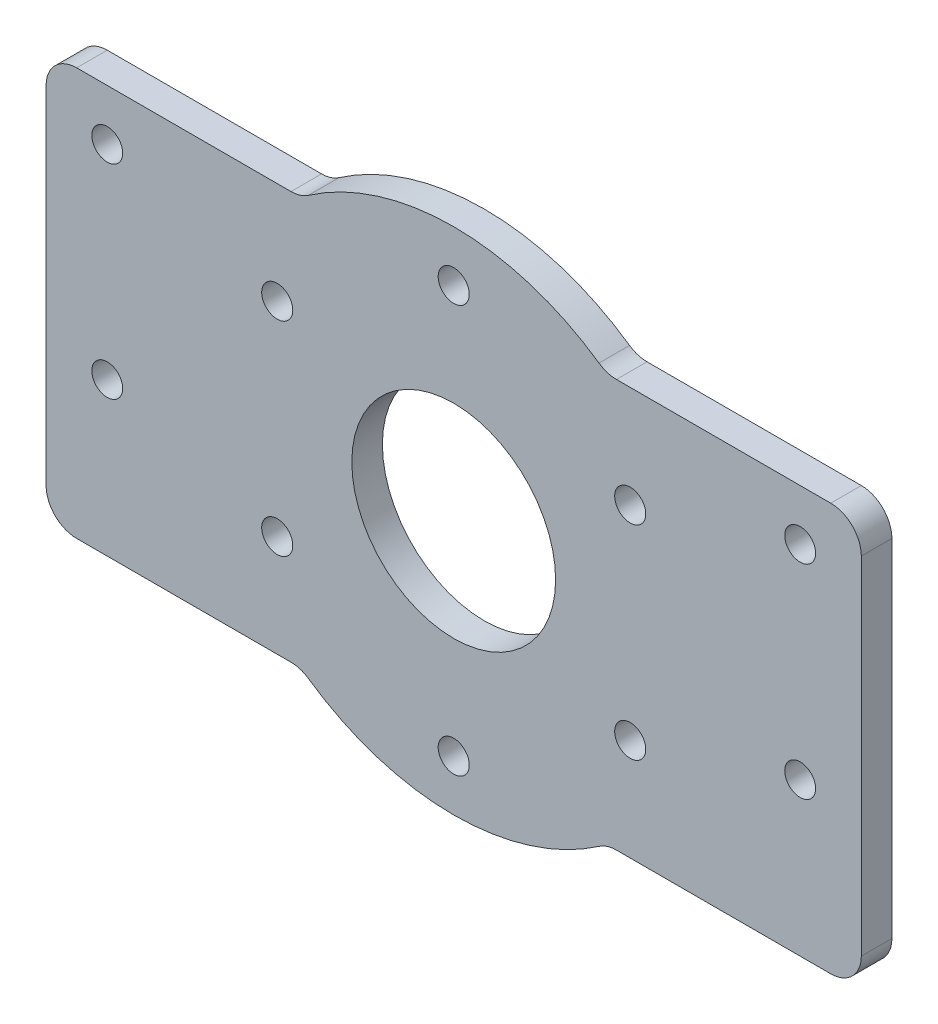
ISO-10303-21;
HEADER;
FILE_DESCRIPTION(('STEP AP214'),'2;1');
FILE_NAME('part.step','',(''),(''),'','','');
FILE_SCHEMA(('AUTOMOTIVE_DESIGN { 1 0 10303 214 1 1 1 1 }'));
ENDSEC;
DATA;
#1=APPLICATION_CONTEXT('core data for automotive mechanical design processes');
#2=APPLICATION_PROTOCOL_DEFINITION('international standard','automotive_design',2000,#1);
#3=PRODUCT_CONTEXT('',#1,'mechanical');
#4=PRODUCT('Part','Part','',(#3));
#5=PRODUCT_RELATED_PRODUCT_CATEGORY('part','',(#4));
#6=PRODUCT_DEFINITION_FORMATION('','',#4);
#7=PRODUCT_DEFINITION_CONTEXT('part definition',#1,'design');
#8=PRODUCT_DEFINITION('design','',#6,#7);
#9=PRODUCT_DEFINITION_SHAPE('','',#8);
#10=(LENGTH_UNIT() NAMED_UNIT(*) SI_UNIT(.MILLI.,.METRE.));
#11=(NAMED_UNIT(*) PLANE_ANGLE_UNIT() SI_UNIT($,.RADIAN.));
#12=(NAMED_UNIT(*) SI_UNIT($,.STERADIAN.) SOLID_ANGLE_UNIT());
#13=UNCERTAINTY_MEASURE_WITH_UNIT(LENGTH_MEASURE(1.E-05),#10,'distance_accuracy_value','');
#14=(GEOMETRIC_REPRESENTATION_CONTEXT(3) GLOBAL_UNCERTAINTY_ASSIGNED_CONTEXT((#13)) GLOBAL_UNIT_ASSIGNED_CONTEXT((#10,
#11,#12)) REPRESENTATION_CONTEXT('',''));
#15=CARTESIAN_POINT('',(0.,0.,0.));
#16=DIRECTION('',(0.,0.,1.));
#17=DIRECTION('',(1.,0.,0.));
#18=AXIS2_PLACEMENT_3D('',#15,#16,#17);
#19=CARTESIAN_POINT('',(0.,0.,3.));
#20=DIRECTION('',(0.,0.,-1.));
#21=DIRECTION('',(-1.,0.,0.));
#22=AXIS2_PLACEMENT_3D('',#19,#20,#21);
#23=CYLINDRICAL_SURFACE('',#22,25.);
#24=CARTESIAN_POINT('',(0.,0.,0.));
#25=DIRECTION('',(0.,0.,1.));
#26=DIRECTION('',(1.,0.,0.));
#27=AXIS2_PLACEMENT_3D('',#24,#25,#26);
#28=CIRCLE('',#27,25.);
#29=CARTESIAN_POINT('',(14.2577851988137,20.5357142857143,0.));
#30=VERTEX_POINT('',#29);
#31=CARTESIAN_POINT('',(-14.2577851988137,20.5357142857143,0.));
#32=VERTEX_POINT('',#31);
#33=EDGE_CURVE('E153',#30,#32,#28,.T.);
#34=ORIENTED_EDGE('',*,*,#33,.T.);
#35=DIRECTION('',(0.,0.,-1.));
#36=VECTOR('',#35,1.);
#37=CARTESIAN_POINT('',(-14.2577851988137,20.5357142857143,3.));
#38=LINE('',#37,#36);
#39=CARTESIAN_POINT('',(-14.2577851988137,20.5357142857143,3.));
#40=VERTEX_POINT('',#39);
#41=EDGE_CURVE('E159',#32,#40,#38,.F.);
#42=ORIENTED_EDGE('',*,*,#41,.T.);
#43=CARTESIAN_POINT('',(0.,0.,3.));
#44=DIRECTION('',(0.,0.,1.));
#45=DIRECTION('',(1.,0.,0.));
#46=AXIS2_PLACEMENT_3D('',#43,#44,#45);
#47=CIRCLE('',#46,25.);
#48=CARTESIAN_POINT('',(14.2577851988137,20.5357142857143,3.));
#49=VERTEX_POINT('',#48);
#50=EDGE_CURVE('E156',#49,#40,#47,.T.);
#51=ORIENTED_EDGE('',*,*,#50,.F.);
#52=DIRECTION('',(0.,0.,-1.));
#53=VECTOR('',#52,1.);
#54=CARTESIAN_POINT('',(14.2577851988137,20.5357142857143,3.));
#55=LINE('',#54,#53);
#56=EDGE_CURVE('E150',#49,#30,#55,.T.);
#57=ORIENTED_EDGE('',*,*,#56,.T.);
#58=EDGE_LOOP('',(#34,#42,#51,#57));
#59=FACE_BOUND('',#58,.T.);
#60=ADVANCED_FACE('F34',(#59),#23,.T.);
#61=CARTESIAN_POINT('',(0.,0.,3.));
#62=DIRECTION('',(0.,0.,1.));
#63=DIRECTION('',(1.,0.,0.));
#64=AXIS2_PLACEMENT_3D('',#61,#62,#63);
#65=PLANE('',#64);
#66=CARTESIAN_POINT('',(34.,15.,3.));
#67=DIRECTION('',(0.,0.,1.));
#68=DIRECTION('',(-1.,0.,0.));
#69=AXIS2_PLACEMENT_3D('',#66,#67,#68);
#70=CIRCLE('',#69,1.51499999999942);
#71=CARTESIAN_POINT('',(32.4850000000006,15.,3.));
#72=VERTEX_POINT('',#71);
#73=EDGE_CURVE('E581',#72,#72,#70,.T.);
#74=ORIENTED_EDGE('',*,*,#73,.F.);
#75=EDGE_LOOP('',(#74));
#76=FACE_BOUND('',#75,.T.);
#77=CARTESIAN_POINT('',(34.,-5.,3.));
#78=DIRECTION('',(0.,0.,1.));
#79=DIRECTION('',(-1.,0.,0.));
#80=AXIS2_PLACEMENT_3D('',#77,#78,#79);
#81=CIRCLE('',#80,1.51499999999942);
#82=CARTESIAN_POINT('',(32.4850000000006,-5.,3.));
#83=VERTEX_POINT('',#82);
#84=EDGE_CURVE('E582',#83,#83,#81,.T.);
#85=ORIENTED_EDGE('',*,*,#84,.F.);
#86=EDGE_LOOP('',(#85));
#87=FACE_BOUND('',#86,.T.);
#88=CARTESIAN_POINT('',(-34.,-5.,3.));
#89=DIRECTION('',(0.,0.,1.));
#90=DIRECTION('',(1.,0.,0.));
#91=AXIS2_PLACEMENT_3D('',#88,#89,#90);
#92=CIRCLE('',#91,1.51499999999943);
#93=CARTESIAN_POINT('',(-32.4850000000006,-5.,3.));
#94=VERTEX_POINT('',#93);
#95=EDGE_CURVE('E585',#94,#94,#92,.T.);
#96=ORIENTED_EDGE('',*,*,#95,.F.);
#97=EDGE_LOOP('',(#96));
#98=FACE_BOUND('',#97,.T.);
#99=CARTESIAN_POINT('',(-34.,15.,3.));
#100=DIRECTION('',(0.,0.,1.));
#101=DIRECTION('',(1.,0.,0.));
#102=AXIS2_PLACEMENT_3D('',#99,#100,#101);
#103=CIRCLE('',#102,1.51499999999943);
#104=CARTESIAN_POINT('',(-32.4850000000006,15.,3.));
#105=VERTEX_POINT('',#104);
#106=EDGE_CURVE('E188',#105,#105,#103,.T.);
#107=ORIENTED_EDGE('',*,*,#106,.F.);
#108=EDGE_LOOP('',(#107));
#109=FACE_BOUND('',#108,.T.);
#110=CARTESIAN_POINT('',(-17.3205080756887,10.0000000000002,3.));
#111=DIRECTION('',(0.,0.,1.));
#112=DIRECTION('',(1.,0.,0.));
#113=AXIS2_PLACEMENT_3D('',#110,#111,#112);
#114=CIRCLE('',#113,1.525);
#115=CARTESIAN_POINT('',(-15.7955080756887,10.0000000000002,3.));
#116=VERTEX_POINT('',#115);
#117=EDGE_CURVE('E239',#116,#116,#114,.T.);
#118=ORIENTED_EDGE('',*,*,#117,.F.);
#119=EDGE_LOOP('',(#118));
#120=FACE_BOUND('',#119,.T.);
#121=CARTESIAN_POINT('',(17.3205080756886,-10.0000000000003,3.));
#122=DIRECTION('',(0.,0.,1.));
#123=DIRECTION('',(1.,0.,0.));
#124=AXIS2_PLACEMENT_3D('',#121,#122,#123);
#125=CIRCLE('',#124,1.525);
#126=CARTESIAN_POINT('',(18.8455080756886,-10.0000000000003,3.));
#127=VERTEX_POINT('',#126);
#128=EDGE_CURVE('E251',#127,#127,#125,.T.);
#129=ORIENTED_EDGE('',*,*,#128,.F.);
#130=EDGE_LOOP('',(#129));
#131=FACE_BOUND('',#130,.T.);
#132=CARTESIAN_POINT('',(-17.3205080756889,-9.99999999999984,3.));
#133=DIRECTION('',(0.,0.,1.));
#134=DIRECTION('',(1.,0.,0.));
#135=AXIS2_PLACEMENT_3D('',#132,#133,#134);
#136=CIRCLE('',#135,1.525);
#137=CARTESIAN_POINT('',(-15.7955080756889,-9.99999999999984,3.));
#138=VERTEX_POINT('',#137);
#139=EDGE_CURVE('E263',#138,#138,#136,.T.);
#140=ORIENTED_EDGE('',*,*,#139,.F.);
#141=EDGE_LOOP('',(#140));
#142=FACE_BOUND('',#141,.T.);
#143=DIRECTION('',(-1.,0.,0.));
#144=VECTOR('',#143,1.);
#145=CARTESIAN_POINT('',(-40.,20.,3.));
#146=LINE('',#145,#144);
#147=CARTESIAN_POINT('',(-15.9687194226713,20.,3.));
#148=VERTEX_POINT('',#147);
#149=CARTESIAN_POINT('',(-37.,20.,3.));
#150=VERTEX_POINT('',#149);
#151=EDGE_CURVE('E204',#148,#150,#146,.T.);
#152=ORIENTED_EDGE('',*,*,#151,.T.);
#153=CARTESIAN_POINT('',(-37.,17.,3.));
#154=DIRECTION('',(0.,0.,1.));
#155=DIRECTION('',(1.,0.,0.));
#156=AXIS2_PLACEMENT_3D('',#153,#154,#155);
#157=CIRCLE('',#156,3.);
#158=CARTESIAN_POINT('',(-40.,17.,3.));
#159=VERTEX_POINT('',#158);
#160=EDGE_CURVE('E289',#150,#159,#157,.T.);
#161=ORIENTED_EDGE('',*,*,#160,.T.);
#162=DIRECTION('',(0.,-1.,0.));
#163=VECTOR('',#162,1.);
#164=CARTESIAN_POINT('',(-40.,-20.,3.));
#165=LINE('',#164,#163);
#166=CARTESIAN_POINT('',(-40.,-17.,3.));
#167=VERTEX_POINT('',#166);
#168=EDGE_CURVE('E195',#159,#167,#165,.T.);
#169=ORIENTED_EDGE('',*,*,#168,.T.);
#170=CARTESIAN_POINT('',(-37.,-17.,3.));
#171=DIRECTION('',(0.,0.,1.));
#172=DIRECTION('',(1.,0.,0.));
#173=AXIS2_PLACEMENT_3D('',#170,#171,#172);
#174=CIRCLE('',#173,3.);
#175=CARTESIAN_POINT('',(-37.,-20.,3.));
#176=VERTEX_POINT('',#175);
#177=EDGE_CURVE('E283',#167,#176,#174,.T.);
#178=ORIENTED_EDGE('',*,*,#177,.T.);
#179=DIRECTION('',(1.,0.,0.));
#180=VECTOR('',#179,1.);
#181=CARTESIAN_POINT('',(-40.,-20.,3.));
#182=LINE('',#181,#180);
#183=CARTESIAN_POINT('',(-15.9687194226713,-20.,3.));
#184=VERTEX_POINT('',#183);
#185=EDGE_CURVE('E199',#176,#184,#182,.T.);
#186=ORIENTED_EDGE('',*,*,#185,.T.);
#187=CARTESIAN_POINT('',(-15.9687194226713,-23.,3.));
#188=DIRECTION('',(0.,0.,1.));
#189=DIRECTION('',(1.,0.,0.));
#190=AXIS2_PLACEMENT_3D('',#187,#188,#189);
#191=CIRCLE('',#190,3.);
#192=CARTESIAN_POINT('',(-14.2577851988137,-20.5357142857143,3.));
#193=VERTEX_POINT('',#192);
#194=EDGE_CURVE('E43',#184,#193,#191,.F.);
#195=ORIENTED_EDGE('',*,*,#194,.T.);
#196=CARTESIAN_POINT('',(14.2577851988137,-20.5357142857143,3.));
#197=VERTEX_POINT('',#196);
#198=EDGE_CURVE('E170',#193,#197,#47,.T.);
#199=ORIENTED_EDGE('',*,*,#198,.T.);
#200=CARTESIAN_POINT('',(15.9687194226713,-23.,3.));
#201=DIRECTION('',(0.,0.,1.));
#202=DIRECTION('',(1.,0.,0.));
#203=AXIS2_PLACEMENT_3D('',#200,#201,#202);
#204=CIRCLE('',#203,3.);
#205=CARTESIAN_POINT('',(15.9687194226713,-20.,3.));
#206=VERTEX_POINT('',#205);
#207=EDGE_CURVE('E329',#197,#206,#204,.F.);
#208=ORIENTED_EDGE('',*,*,#207,.T.);
#209=DIRECTION('',(1.,0.,0.));
#210=VECTOR('',#209,1.);
#211=CARTESIAN_POINT('',(15.,-20.,3.));
#212=LINE('',#211,#210);
#213=CARTESIAN_POINT('',(37.,-20.,3.));
#214=VERTEX_POINT('',#213);
#215=EDGE_CURVE('E220',#206,#214,#212,.T.);
#216=ORIENTED_EDGE('',*,*,#215,.T.);
#217=CARTESIAN_POINT('',(37.,-17.,3.));
#218=DIRECTION('',(0.,0.,1.));
#219=DIRECTION('',(1.,0.,0.));
#220=AXIS2_PLACEMENT_3D('',#217,#218,#219);
#221=CIRCLE('',#220,3.);
#222=CARTESIAN_POINT('',(40.,-17.,3.));
#223=VERTEX_POINT('',#222);
#224=EDGE_CURVE('E287',#214,#223,#221,.T.);
#225=ORIENTED_EDGE('',*,*,#224,.T.);
#226=DIRECTION('',(0.,1.,0.));
#227=VECTOR('',#226,1.);
#228=CARTESIAN_POINT('',(40.,-20.,3.));
#229=LINE('',#228,#227);
#230=CARTESIAN_POINT('',(40.,17.,3.));
#231=VERTEX_POINT('',#230);
#232=EDGE_CURVE('E215',#223,#231,#229,.T.);
#233=ORIENTED_EDGE('',*,*,#232,.T.);
#234=CARTESIAN_POINT('',(37.,17.,3.));
#235=DIRECTION('',(0.,0.,1.));
#236=DIRECTION('',(1.,0.,0.));
#237=AXIS2_PLACEMENT_3D('',#234,#235,#236);
#238=CIRCLE('',#237,3.);
#239=CARTESIAN_POINT('',(37.,20.,3.));
#240=VERTEX_POINT('',#239);
#241=EDGE_CURVE('E285',#231,#240,#238,.T.);
#242=ORIENTED_EDGE('',*,*,#241,.T.);
#243=DIRECTION('',(-1.,0.,0.));
#244=VECTOR('',#243,1.);
#245=CARTESIAN_POINT('',(15.,20.,3.));
#246=LINE('',#245,#244);
#247=CARTESIAN_POINT('',(15.9687194226713,20.,3.));
#248=VERTEX_POINT('',#247);
#249=EDGE_CURVE('E226',#240,#248,#246,.T.);
#250=ORIENTED_EDGE('',*,*,#249,.T.);
#251=CARTESIAN_POINT('',(15.9687194226713,23.,3.));
#252=DIRECTION('',(0.,0.,1.));
#253=DIRECTION('',(1.,0.,0.));
#254=AXIS2_PLACEMENT_3D('',#251,#252,#253);
#255=CIRCLE('',#254,3.);
#256=EDGE_CURVE('E177',#248,#49,#255,.F.);
#257=ORIENTED_EDGE('',*,*,#256,.T.);
#258=ORIENTED_EDGE('',*,*,#50,.T.);
#259=CARTESIAN_POINT('',(-15.9687194226713,23.,3.));
#260=DIRECTION('',(0.,0.,1.));
#261=DIRECTION('',(1.,0.,0.));
#262=AXIS2_PLACEMENT_3D('',#259,#260,#261);
#263=CIRCLE('',#262,3.);
#264=EDGE_CURVE('E326',#40,#148,#263,.F.);
#265=ORIENTED_EDGE('',*,*,#264,.T.);
#266=EDGE_LOOP('',(#152,#161,#169,#178,#186,#195,#199,#208,#216,#225,#233,#242,#250,#257,#258,#265));
#267=FACE_BOUND('',#266,.T.);
#268=CARTESIAN_POINT('',(0.,20.,3.));
#269=DIRECTION('',(0.,0.,1.));
#270=DIRECTION('',(1.,0.,0.));
#271=AXIS2_PLACEMENT_3D('',#268,#269,#270);
#272=CIRCLE('',#271,1.525);
#273=CARTESIAN_POINT('',(1.525,20.,3.));
#274=VERTEX_POINT('',#273);
#275=EDGE_CURVE('E269',#274,#274,#272,.T.);
#276=ORIENTED_EDGE('',*,*,#275,.F.);
#277=EDGE_LOOP('',(#276));
#278=FACE_BOUND('',#277,.T.);
#279=CARTESIAN_POINT('',(17.3205080756889,9.99999999999972,3.));
#280=DIRECTION('',(0.,0.,1.));
#281=DIRECTION('',(1.,0.,0.));
#282=AXIS2_PLACEMENT_3D('',#279,#280,#281);
#283=CIRCLE('',#282,1.525);
#284=CARTESIAN_POINT('',(18.8455080756889,9.99999999999972,3.));
#285=VERTEX_POINT('',#284);
#286=EDGE_CURVE('E257',#285,#285,#283,.T.);
#287=ORIENTED_EDGE('',*,*,#286,.F.);
#288=EDGE_LOOP('',(#287));
#289=FACE_BOUND('',#288,.T.);
#290=CARTESIAN_POINT('',(-1.37209959955431E-13,-20.,3.));
#291=DIRECTION('',(0.,0.,1.));
#292=DIRECTION('',(1.,0.,0.));
#293=AXIS2_PLACEMENT_3D('',#290,#291,#292);
#294=CIRCLE('',#293,1.525);
#295=CARTESIAN_POINT('',(1.52499999999986,-20.,3.));
#296=VERTEX_POINT('',#295);
#297=EDGE_CURVE('E245',#296,#296,#294,.T.);
#298=ORIENTED_EDGE('',*,*,#297,.F.);
#299=EDGE_LOOP('',(#298));
#300=FACE_BOUND('',#299,.T.);
#301=CARTESIAN_POINT('',(0.,0.,3.));
#302=DIRECTION('',(0.,0.,1.));
#303=DIRECTION('',(1.,0.,0.));
#304=AXIS2_PLACEMENT_3D('',#301,#302,#303);
#305=CIRCLE('',#304,10.);
#306=CARTESIAN_POINT('',(10.,0.,3.));
#307=VERTEX_POINT('',#306);
#308=EDGE_CURVE('E233',#307,#307,#305,.T.);
#309=ORIENTED_EDGE('',*,*,#308,.F.);
#310=EDGE_LOOP('',(#309));
#311=FACE_BOUND('',#310,.T.);
#312=ADVANCED_FACE('F341',(#76,#87,#98,#109,#120,#131,#142,#267,#278,#289,#300,#311),#65,.T.);
#313=CARTESIAN_POINT('',(0.,0.,0.));
#314=DIRECTION('',(0.,0.,1.));
#315=DIRECTION('',(1.,0.,0.));
#316=AXIS2_PLACEMENT_3D('',#313,#314,#315);
#317=PLANE('',#316);
#318=CARTESIAN_POINT('',(34.,15.,0.));
#319=DIRECTION('',(0.,0.,1.));
#320=DIRECTION('',(1.,0.,0.));
#321=AXIS2_PLACEMENT_3D('',#318,#319,#320);
#322=CIRCLE('',#321,1.51499999999942);
#323=CARTESIAN_POINT('',(35.5149999999994,15.,0.));
#324=VERTEX_POINT('',#323);
#325=EDGE_CURVE('E38',#324,#324,#322,.T.);
#326=ORIENTED_EDGE('',*,*,#325,.T.);
#327=EDGE_LOOP('',(#326));
#328=FACE_BOUND('',#327,.T.);
#329=CARTESIAN_POINT('',(34.,-5.,0.));
#330=DIRECTION('',(0.,0.,1.));
#331=DIRECTION('',(1.,0.,0.));
#332=AXIS2_PLACEMENT_3D('',#329,#330,#331);
#333=CIRCLE('',#332,1.51499999999942);
#334=CARTESIAN_POINT('',(35.5149999999994,-5.,0.));
#335=VERTEX_POINT('',#334);
#336=EDGE_CURVE('E190',#335,#335,#333,.T.);
#337=ORIENTED_EDGE('',*,*,#336,.T.);
#338=EDGE_LOOP('',(#337));
#339=FACE_BOUND('',#338,.T.);
#340=CARTESIAN_POINT('',(-34.,-5.,0.));
#341=DIRECTION('',(0.,0.,1.));
#342=DIRECTION('',(1.,0.,0.));
#343=AXIS2_PLACEMENT_3D('',#340,#341,#342);
#344=CIRCLE('',#343,1.51499999999943);
#345=CARTESIAN_POINT('',(-32.4850000000006,-5.,0.));
#346=VERTEX_POINT('',#345);
#347=EDGE_CURVE('E187',#346,#346,#344,.T.);
#348=ORIENTED_EDGE('',*,*,#347,.T.);
#349=EDGE_LOOP('',(#348));
#350=FACE_BOUND('',#349,.T.);
#351=CARTESIAN_POINT('',(-34.,15.,0.));
#352=DIRECTION('',(0.,0.,1.));
#353=DIRECTION('',(1.,0.,0.));
#354=AXIS2_PLACEMENT_3D('',#351,#352,#353);
#355=CIRCLE('',#354,1.51499999999943);
#356=CARTESIAN_POINT('',(-32.4850000000006,15.,0.));
#357=VERTEX_POINT('',#356);
#358=EDGE_CURVE('E184',#357,#357,#355,.T.);
#359=ORIENTED_EDGE('',*,*,#358,.T.);
#360=EDGE_LOOP('',(#359));
#361=FACE_BOUND('',#360,.T.);
#362=DIRECTION('',(0.,1.,0.));
#363=VECTOR('',#362,1.);
#364=CARTESIAN_POINT('',(-40.,-20.,0.));
#365=LINE('',#364,#363);
#366=CARTESIAN_POINT('',(-40.,-17.,0.));
#367=VERTEX_POINT('',#366);
#368=CARTESIAN_POINT('',(-40.,17.,0.));
#369=VERTEX_POINT('',#368);
#370=EDGE_CURVE('E207',#367,#369,#365,.T.);
#371=ORIENTED_EDGE('',*,*,#370,.T.);
#372=CARTESIAN_POINT('',(-37.,17.,0.));
#373=DIRECTION('',(0.,0.,1.));
#374=DIRECTION('',(1.,0.,0.));
#375=AXIS2_PLACEMENT_3D('',#372,#373,#374);
#376=CIRCLE('',#375,3.);
#377=CARTESIAN_POINT('',(-37.,20.,0.));
#378=VERTEX_POINT('',#377);
#379=EDGE_CURVE('E302',#369,#378,#376,.F.);
#380=ORIENTED_EDGE('',*,*,#379,.T.);
#381=DIRECTION('',(1.,0.,0.));
#382=VECTOR('',#381,1.);
#383=CARTESIAN_POINT('',(-40.,20.,0.));
#384=LINE('',#383,#382);
#385=CARTESIAN_POINT('',(-15.9687194226713,20.,0.));
#386=VERTEX_POINT('',#385);
#387=EDGE_CURVE('E212',#378,#386,#384,.T.);
#388=ORIENTED_EDGE('',*,*,#387,.T.);
#389=CARTESIAN_POINT('',(-15.9687194226713,23.,0.));
#390=DIRECTION('',(0.,0.,1.));
#391=DIRECTION('',(1.,0.,0.));
#392=AXIS2_PLACEMENT_3D('',#389,#390,#391);
#393=CIRCLE('',#392,3.);
#394=EDGE_CURVE('E169',#386,#32,#393,.T.);
#395=ORIENTED_EDGE('',*,*,#394,.T.);
#396=ORIENTED_EDGE('',*,*,#33,.F.);
#397=CARTESIAN_POINT('',(15.9687194226713,23.,0.));
#398=DIRECTION('',(0.,0.,1.));
#399=DIRECTION('',(1.,0.,0.));
#400=AXIS2_PLACEMENT_3D('',#397,#398,#399);
#401=CIRCLE('',#400,3.);
#402=CARTESIAN_POINT('',(15.9687194226713,20.,0.));
#403=VERTEX_POINT('',#402);
#404=EDGE_CURVE('E165',#30,#403,#401,.T.);
#405=ORIENTED_EDGE('',*,*,#404,.T.);
#406=DIRECTION('',(1.,0.,0.));
#407=VECTOR('',#406,1.);
#408=CARTESIAN_POINT('',(15.,20.,0.));
#409=LINE('',#408,#407);
#410=CARTESIAN_POINT('',(37.,20.,0.));
#411=VERTEX_POINT('',#410);
#412=EDGE_CURVE('E223',#403,#411,#409,.T.);
#413=ORIENTED_EDGE('',*,*,#412,.T.);
#414=CARTESIAN_POINT('',(37.,17.,0.));
#415=DIRECTION('',(0.,0.,1.));
#416=DIRECTION('',(1.,0.,0.));
#417=AXIS2_PLACEMENT_3D('',#414,#415,#416);
#418=CIRCLE('',#417,3.);
#419=CARTESIAN_POINT('',(40.,17.,0.));
#420=VERTEX_POINT('',#419);
#421=EDGE_CURVE('E298',#411,#420,#418,.F.);
#422=ORIENTED_EDGE('',*,*,#421,.T.);
#423=DIRECTION('',(0.,-1.,0.));
#424=VECTOR('',#423,1.);
#425=CARTESIAN_POINT('',(40.,-20.,0.));
#426=LINE('',#425,#424);
#427=CARTESIAN_POINT('',(40.,-17.,0.));
#428=VERTEX_POINT('',#427);
#429=EDGE_CURVE('E219',#420,#428,#426,.T.);
#430=ORIENTED_EDGE('',*,*,#429,.T.);
#431=CARTESIAN_POINT('',(37.,-17.,0.));
#432=DIRECTION('',(0.,0.,1.));
#433=DIRECTION('',(1.,0.,0.));
#434=AXIS2_PLACEMENT_3D('',#431,#432,#433);
#435=CIRCLE('',#434,3.);
#436=CARTESIAN_POINT('',(37.,-20.,0.));
#437=VERTEX_POINT('',#436);
#438=EDGE_CURVE('E300',#428,#437,#435,.F.);
#439=ORIENTED_EDGE('',*,*,#438,.T.);
#440=DIRECTION('',(-1.,0.,0.));
#441=VECTOR('',#440,1.);
#442=CARTESIAN_POINT('',(15.,-20.,0.));
#443=LINE('',#442,#441);
#444=CARTESIAN_POINT('',(15.9687194226713,-20.,0.));
#445=VERTEX_POINT('',#444);
#446=EDGE_CURVE('E216',#437,#445,#443,.T.);
#447=ORIENTED_EDGE('',*,*,#446,.T.);
#448=CARTESIAN_POINT('',(15.9687194226713,-23.,0.));
#449=DIRECTION('',(0.,0.,1.));
#450=DIRECTION('',(1.,0.,0.));
#451=AXIS2_PLACEMENT_3D('',#448,#449,#450);
#452=CIRCLE('',#451,3.);
#453=CARTESIAN_POINT('',(14.2577851988137,-20.5357142857143,0.));
#454=VERTEX_POINT('',#453);
#455=EDGE_CURVE('E180',#445,#454,#452,.T.);
#456=ORIENTED_EDGE('',*,*,#455,.T.);
#457=CARTESIAN_POINT('',(-14.2577851988137,-20.5357142857143,0.));
#458=VERTEX_POINT('',#457);
#459=EDGE_CURVE('E171',#458,#454,#28,.T.);
#460=ORIENTED_EDGE('',*,*,#459,.F.);
#461=CARTESIAN_POINT('',(-15.9687194226713,-23.,0.));
#462=DIRECTION('',(0.,0.,1.));
#463=DIRECTION('',(1.,0.,0.));
#464=AXIS2_PLACEMENT_3D('',#461,#462,#463);
#465=CIRCLE('',#464,3.);
#466=CARTESIAN_POINT('',(-15.9687194226713,-20.,0.));
#467=VERTEX_POINT('',#466);
#468=EDGE_CURVE('E11',#458,#467,#465,.T.);
#469=ORIENTED_EDGE('',*,*,#468,.T.);
#470=DIRECTION('',(-1.,0.,0.));
#471=VECTOR('',#470,1.);
#472=CARTESIAN_POINT('',(-40.,-20.,0.));
#473=LINE('',#472,#471);
#474=CARTESIAN_POINT('',(-37.,-20.,0.));
#475=VERTEX_POINT('',#474);
#476=EDGE_CURVE('E213',#467,#475,#473,.T.);
#477=ORIENTED_EDGE('',*,*,#476,.T.);
#478=CARTESIAN_POINT('',(-37.,-17.,0.));
#479=DIRECTION('',(0.,0.,1.));
#480=DIRECTION('',(1.,0.,0.));
#481=AXIS2_PLACEMENT_3D('',#478,#479,#480);
#482=CIRCLE('',#481,3.);
#483=EDGE_CURVE('E296',#475,#367,#482,.F.);
#484=ORIENTED_EDGE('',*,*,#483,.T.);
#485=EDGE_LOOP('',(#371,#380,#388,#395,#396,#405,#413,#422,#430,#439,#447,#456,#460,#469,#477,#484));
#486=FACE_BOUND('',#485,.T.);
#487=CARTESIAN_POINT('',(0.,20.,0.));
#488=DIRECTION('',(0.,0.,1.));
#489=DIRECTION('',(1.,0.,0.));
#490=AXIS2_PLACEMENT_3D('',#487,#488,#489);
#491=CIRCLE('',#490,1.525);
#492=CARTESIAN_POINT('',(1.525,20.,0.));
#493=VERTEX_POINT('',#492);
#494=EDGE_CURVE('E266',#493,#493,#491,.T.);
#495=ORIENTED_EDGE('',*,*,#494,.T.);
#496=EDGE_LOOP('',(#495));
#497=FACE_BOUND('',#496,.T.);
#498=CARTESIAN_POINT('',(-17.3205080756889,-9.99999999999984,0.));
#499=DIRECTION('',(0.,0.,1.));
#500=DIRECTION('',(1.,0.,0.));
#501=AXIS2_PLACEMENT_3D('',#498,#499,#500);
#502=CIRCLE('',#501,1.525);
#503=CARTESIAN_POINT('',(-15.7955080756889,-9.99999999999984,0.));
#504=VERTEX_POINT('',#503);
#505=EDGE_CURVE('E260',#504,#504,#502,.T.);
#506=ORIENTED_EDGE('',*,*,#505,.T.);
#507=EDGE_LOOP('',(#506));
#508=FACE_BOUND('',#507,.T.);
#509=CARTESIAN_POINT('',(17.3205080756889,9.99999999999972,0.));
#510=DIRECTION('',(0.,0.,1.));
#511=DIRECTION('',(1.,0.,0.));
#512=AXIS2_PLACEMENT_3D('',#509,#510,#511);
#513=CIRCLE('',#512,1.525);
#514=CARTESIAN_POINT('',(18.8455080756889,9.99999999999972,0.));
#515=VERTEX_POINT('',#514);
#516=EDGE_CURVE('E254',#515,#515,#513,.T.);
#517=ORIENTED_EDGE('',*,*,#516,.T.);
#518=EDGE_LOOP('',(#517));
#519=FACE_BOUND('',#518,.T.);
#520=CARTESIAN_POINT('',(17.3205080756886,-10.0000000000003,0.));
#521=DIRECTION('',(0.,0.,1.));
#522=DIRECTION('',(1.,0.,0.));
#523=AXIS2_PLACEMENT_3D('',#520,#521,#522);
#524=CIRCLE('',#523,1.525);
#525=CARTESIAN_POINT('',(18.8455080756886,-10.0000000000003,0.));
#526=VERTEX_POINT('',#525);
#527=EDGE_CURVE('E248',#526,#526,#524,.T.);
#528=ORIENTED_EDGE('',*,*,#527,.T.);
#529=EDGE_LOOP('',(#528));
#530=FACE_BOUND('',#529,.T.);
#531=CARTESIAN_POINT('',(-1.37209959955431E-13,-20.,0.));
#532=DIRECTION('',(0.,0.,1.));
#533=DIRECTION('',(1.,0.,0.));
#534=AXIS2_PLACEMENT_3D('',#531,#532,#533);
#535=CIRCLE('',#534,1.525);
#536=CARTESIAN_POINT('',(1.52499999999986,-20.,0.));
#537=VERTEX_POINT('',#536);
#538=EDGE_CURVE('E242',#537,#537,#535,.T.);
#539=ORIENTED_EDGE('',*,*,#538,.T.);
#540=EDGE_LOOP('',(#539));
#541=FACE_BOUND('',#540,.T.);
#542=CARTESIAN_POINT('',(-17.3205080756887,10.0000000000002,0.));
#543=DIRECTION('',(0.,0.,1.));
#544=DIRECTION('',(1.,0.,0.));
#545=AXIS2_PLACEMENT_3D('',#542,#543,#544);
#546=CIRCLE('',#545,1.525);
#547=CARTESIAN_POINT('',(-15.7955080756887,10.0000000000002,0.));
#548=VERTEX_POINT('',#547);
#549=EDGE_CURVE('E236',#548,#548,#546,.T.);
#550=ORIENTED_EDGE('',*,*,#549,.T.);
#551=EDGE_LOOP('',(#550));
#552=FACE_BOUND('',#551,.T.);
#553=CARTESIAN_POINT('',(0.,0.,0.));
#554=DIRECTION('',(0.,0.,1.));
#555=DIRECTION('',(1.,0.,0.));
#556=AXIS2_PLACEMENT_3D('',#553,#554,#555);
#557=CIRCLE('',#556,10.);
#558=CARTESIAN_POINT('',(10.,0.,0.));
#559=VERTEX_POINT('',#558);
#560=EDGE_CURVE('E232',#559,#559,#557,.T.);
#561=ORIENTED_EDGE('',*,*,#560,.T.);
#562=EDGE_LOOP('',(#561));
#563=FACE_BOUND('',#562,.T.);
#564=ADVANCED_FACE('F162',(#328,#339,#350,#361,#486,#497,#508,#519,#530,#541,#552,#563),#317,.F.);
#565=ORIENTED_EDGE('',*,*,#459,.T.);
#566=DIRECTION('',(0.,0.,-1.));
#567=VECTOR('',#566,1.);
#568=CARTESIAN_POINT('',(14.2577851988137,-20.5357142857143,3.));
#569=LINE('',#568,#567);
#570=EDGE_CURVE('E306',#454,#197,#569,.F.);
#571=ORIENTED_EDGE('',*,*,#570,.T.);
#572=ORIENTED_EDGE('',*,*,#198,.F.);
#573=DIRECTION('',(0.,0.,-1.));
#574=VECTOR('',#573,1.);
#575=CARTESIAN_POINT('',(-14.2577851988137,-20.5357142857143,3.));
#576=LINE('',#575,#574);
#577=EDGE_CURVE('E304',#193,#458,#576,.T.);
#578=ORIENTED_EDGE('',*,*,#577,.T.);
#579=EDGE_LOOP('',(#565,#571,#572,#578));
#580=FACE_BOUND('',#579,.T.);
#581=ADVANCED_FACE('F336',(#580),#23,.T.);
#582=CARTESIAN_POINT('',(0.,20.,3.));
#583=DIRECTION('',(0.,0.,-1.));
#584=DIRECTION('',(-1.,0.,0.));
#585=AXIS2_PLACEMENT_3D('',#582,#583,#584);
#586=CYLINDRICAL_SURFACE('',#585,1.525);
#587=ORIENTED_EDGE('',*,*,#275,.T.);
#588=EDGE_LOOP('',(#587));
#589=FACE_BOUND('',#588,.T.);
#590=ORIENTED_EDGE('',*,*,#494,.F.);
#591=EDGE_LOOP('',(#590));
#592=FACE_BOUND('',#591,.T.);
#593=ADVANCED_FACE('F384',(#589,#592),#586,.F.);
#594=CARTESIAN_POINT('',(-17.3205080756889,-9.99999999999984,3.));
#595=DIRECTION('',(0.,0.,-1.));
#596=DIRECTION('',(-1.,0.,0.));
#597=AXIS2_PLACEMENT_3D('',#594,#595,#596);
#598=CYLINDRICAL_SURFACE('',#597,1.525);
#599=ORIENTED_EDGE('',*,*,#139,.T.);
#600=EDGE_LOOP('',(#599));
#601=FACE_BOUND('',#600,.T.);
#602=ORIENTED_EDGE('',*,*,#505,.F.);
#603=EDGE_LOOP('',(#602));
#604=FACE_BOUND('',#603,.T.);
#605=ADVANCED_FACE('F389',(#601,#604),#598,.F.);
#606=CARTESIAN_POINT('',(17.3205080756889,9.99999999999972,3.));
#607=DIRECTION('',(0.,0.,-1.));
#608=DIRECTION('',(-1.,0.,0.));
#609=AXIS2_PLACEMENT_3D('',#606,#607,#608);
#610=CYLINDRICAL_SURFACE('',#609,1.525);
#611=ORIENTED_EDGE('',*,*,#286,.T.);
#612=EDGE_LOOP('',(#611));
#613=FACE_BOUND('',#612,.T.);
#614=ORIENTED_EDGE('',*,*,#516,.F.);
#615=EDGE_LOOP('',(#614));
#616=FACE_BOUND('',#615,.T.);
#617=ADVANCED_FACE('F397',(#613,#616),#610,.F.);
#618=CARTESIAN_POINT('',(17.3205080756886,-10.0000000000003,3.));
#619=DIRECTION('',(0.,0.,-1.));
#620=DIRECTION('',(-1.,0.,0.));
#621=AXIS2_PLACEMENT_3D('',#618,#619,#620);
#622=CYLINDRICAL_SURFACE('',#621,1.525);
#623=ORIENTED_EDGE('',*,*,#128,.T.);
#624=EDGE_LOOP('',(#623));
#625=FACE_BOUND('',#624,.T.);
#626=ORIENTED_EDGE('',*,*,#527,.F.);
#627=EDGE_LOOP('',(#626));
#628=FACE_BOUND('',#627,.T.);
#629=ADVANCED_FACE('F401',(#625,#628),#622,.F.);
#630=CARTESIAN_POINT('',(-1.37209959955431E-13,-20.,3.));
#631=DIRECTION('',(0.,0.,-1.));
#632=DIRECTION('',(-1.,0.,0.));
#633=AXIS2_PLACEMENT_3D('',#630,#631,#632);
#634=CYLINDRICAL_SURFACE('',#633,1.525);
#635=ORIENTED_EDGE('',*,*,#297,.T.);
#636=EDGE_LOOP('',(#635));
#637=FACE_BOUND('',#636,.T.);
#638=ORIENTED_EDGE('',*,*,#538,.F.);
#639=EDGE_LOOP('',(#638));
#640=FACE_BOUND('',#639,.T.);
#641=ADVANCED_FACE('F405',(#637,#640),#634,.F.);
#642=CARTESIAN_POINT('',(-17.3205080756887,10.0000000000002,3.));
#643=DIRECTION('',(0.,0.,-1.));
#644=DIRECTION('',(-1.,0.,0.));
#645=AXIS2_PLACEMENT_3D('',#642,#643,#644);
#646=CYLINDRICAL_SURFACE('',#645,1.525);
#647=ORIENTED_EDGE('',*,*,#117,.T.);
#648=EDGE_LOOP('',(#647));
#649=FACE_BOUND('',#648,.T.);
#650=ORIENTED_EDGE('',*,*,#549,.F.);
#651=EDGE_LOOP('',(#650));
#652=FACE_BOUND('',#651,.T.);
#653=ADVANCED_FACE('F409',(#649,#652),#646,.F.);
#654=CARTESIAN_POINT('',(0.,0.,3.));
#655=DIRECTION('',(0.,0.,-1.));
#656=DIRECTION('',(-1.,0.,0.));
#657=AXIS2_PLACEMENT_3D('',#654,#655,#656);
#658=CYLINDRICAL_SURFACE('',#657,10.);
#659=ORIENTED_EDGE('',*,*,#308,.T.);
#660=EDGE_LOOP('',(#659));
#661=FACE_BOUND('',#660,.T.);
#662=ORIENTED_EDGE('',*,*,#560,.F.);
#663=EDGE_LOOP('',(#662));
#664=FACE_BOUND('',#663,.T.);
#665=ADVANCED_FACE('F413',(#661,#664),#658,.F.);
#666=CARTESIAN_POINT('',(40.,-20.,-47.169905660283));
#667=DIRECTION('',(1.,0.,0.));
#668=DIRECTION('',(0.,0.,-1.));
#669=AXIS2_PLACEMENT_3D('',#666,#667,#668);
#670=PLANE('',#669);
#671=ORIENTED_EDGE('',*,*,#232,.F.);
#672=DIRECTION('',(0.,0.,1.));
#673=VECTOR('',#672,1.);
#674=CARTESIAN_POINT('',(40.,-17.,-47.169905660283));
#675=LINE('',#674,#673);
#676=EDGE_CURVE('E317',#223,#428,#675,.F.);
#677=ORIENTED_EDGE('',*,*,#676,.T.);
#678=ORIENTED_EDGE('',*,*,#429,.F.);
#679=DIRECTION('',(0.,0.,1.));
#680=VECTOR('',#679,1.);
#681=CARTESIAN_POINT('',(40.,17.,-47.169905660283));
#682=LINE('',#681,#680);
#683=EDGE_CURVE('E314',#420,#231,#682,.T.);
#684=ORIENTED_EDGE('',*,*,#683,.T.);
#685=EDGE_LOOP('',(#671,#677,#678,#684));
#686=FACE_BOUND('',#685,.T.);
#687=ADVANCED_FACE('F352',(#686),#670,.T.);
#688=CARTESIAN_POINT('',(15.,-20.,-47.169905660283));
#689=DIRECTION('',(0.,-1.,0.));
#690=DIRECTION('',(1.,0.,0.));
#691=AXIS2_PLACEMENT_3D('',#688,#689,#690);
#692=PLANE('',#691);
#693=ORIENTED_EDGE('',*,*,#215,.F.);
#694=DIRECTION('',(0.,0.,-1.));
#695=VECTOR('',#694,1.);
#696=CARTESIAN_POINT('',(15.9687194226713,-20.,-47.169905660283));
#697=LINE('',#696,#695);
#698=EDGE_CURVE('E312',#206,#445,#697,.T.);
#699=ORIENTED_EDGE('',*,*,#698,.T.);
#700=ORIENTED_EDGE('',*,*,#446,.F.);
#701=DIRECTION('',(0.,0.,1.));
#702=VECTOR('',#701,1.);
#703=CARTESIAN_POINT('',(37.,-20.,-47.169905660283));
#704=LINE('',#703,#702);
#705=EDGE_CURVE('E309',#437,#214,#704,.T.);
#706=ORIENTED_EDGE('',*,*,#705,.T.);
#707=EDGE_LOOP('',(#693,#699,#700,#706));
#708=FACE_BOUND('',#707,.T.);
#709=ADVANCED_FACE('F344',(#708),#692,.T.);
#710=CARTESIAN_POINT('',(15.,20.,-47.169905660283));
#711=DIRECTION('',(0.,1.,0.));
#712=DIRECTION('',(-1.,0.,0.));
#713=AXIS2_PLACEMENT_3D('',#710,#711,#712);
#714=PLANE('',#713);
#715=ORIENTED_EDGE('',*,*,#249,.F.);
#716=DIRECTION('',(0.,0.,1.));
#717=VECTOR('',#716,1.);
#718=CARTESIAN_POINT('',(37.,20.,-47.169905660283));
#719=LINE('',#718,#717);
#720=EDGE_CURVE('E320',#240,#411,#719,.F.);
#721=ORIENTED_EDGE('',*,*,#720,.T.);
#722=ORIENTED_EDGE('',*,*,#412,.F.);
#723=DIRECTION('',(0.,0.,-1.));
#724=VECTOR('',#723,1.);
#725=CARTESIAN_POINT('',(15.9687194226713,20.,-47.169905660283));
#726=LINE('',#725,#724);
#727=EDGE_CURVE('E176',#403,#248,#726,.F.);
#728=ORIENTED_EDGE('',*,*,#727,.T.);
#729=EDGE_LOOP('',(#715,#721,#722,#728));
#730=FACE_BOUND('',#729,.T.);
#731=ADVANCED_FACE('F361',(#730),#714,.T.);
#732=CARTESIAN_POINT('',(-40.,-20.,-47.169905660283));
#733=DIRECTION('',(-1.,0.,0.));
#734=DIRECTION('',(0.,0.,1.));
#735=AXIS2_PLACEMENT_3D('',#732,#733,#734);
#736=PLANE('',#735);
#737=ORIENTED_EDGE('',*,*,#168,.F.);
#738=DIRECTION('',(0.,0.,1.));
#739=VECTOR('',#738,1.);
#740=CARTESIAN_POINT('',(-40.,17.,-47.169905660283));
#741=LINE('',#740,#739);
#742=EDGE_CURVE('E294',#159,#369,#741,.F.);
#743=ORIENTED_EDGE('',*,*,#742,.T.);
#744=ORIENTED_EDGE('',*,*,#370,.F.);
#745=DIRECTION('',(0.,0.,1.));
#746=VECTOR('',#745,1.);
#747=CARTESIAN_POINT('',(-40.,-17.,-47.169905660283));
#748=LINE('',#747,#746);
#749=EDGE_CURVE('E291',#367,#167,#748,.T.);
#750=ORIENTED_EDGE('',*,*,#749,.T.);
#751=EDGE_LOOP('',(#737,#743,#744,#750));
#752=FACE_BOUND('',#751,.T.);
#753=ADVANCED_FACE('F363',(#752),#736,.T.);
#754=CARTESIAN_POINT('',(-40.,20.,-47.169905660283));
#755=DIRECTION('',(0.,1.,0.));
#756=DIRECTION('',(-1.,0.,0.));
#757=AXIS2_PLACEMENT_3D('',#754,#755,#756);
#758=PLANE('',#757);
#759=ORIENTED_EDGE('',*,*,#151,.F.);
#760=DIRECTION('',(0.,0.,-1.));
#761=VECTOR('',#760,1.);
#762=CARTESIAN_POINT('',(-15.9687194226713,20.,-47.169905660283));
#763=LINE('',#762,#761);
#764=EDGE_CURVE('E281',#148,#386,#763,.T.);
#765=ORIENTED_EDGE('',*,*,#764,.T.);
#766=ORIENTED_EDGE('',*,*,#387,.F.);
#767=DIRECTION('',(0.,0.,1.));
#768=VECTOR('',#767,1.);
#769=CARTESIAN_POINT('',(-37.,20.,-47.169905660283));
#770=LINE('',#769,#768);
#771=EDGE_CURVE('E278',#378,#150,#770,.T.);
#772=ORIENTED_EDGE('',*,*,#771,.T.);
#773=EDGE_LOOP('',(#759,#765,#766,#772));
#774=FACE_BOUND('',#773,.T.);
#775=ADVANCED_FACE('F369',(#774),#758,.T.);
#776=CARTESIAN_POINT('',(-40.,-20.,-47.169905660283));
#777=DIRECTION('',(0.,-1.,0.));
#778=DIRECTION('',(1.,0.,0.));
#779=AXIS2_PLACEMENT_3D('',#776,#777,#778);
#780=PLANE('',#779);
#781=ORIENTED_EDGE('',*,*,#476,.F.);
#782=DIRECTION('',(0.,0.,-1.));
#783=VECTOR('',#782,1.);
#784=CARTESIAN_POINT('',(-15.9687194226713,-20.,-47.169905660283));
#785=LINE('',#784,#783);
#786=EDGE_CURVE('E323',#467,#184,#785,.F.);
#787=ORIENTED_EDGE('',*,*,#786,.T.);
#788=ORIENTED_EDGE('',*,*,#185,.F.);
#789=DIRECTION('',(0.,0.,1.));
#790=VECTOR('',#789,1.);
#791=CARTESIAN_POINT('',(-37.,-20.,-47.169905660283));
#792=LINE('',#791,#790);
#793=EDGE_CURVE('E51',#176,#475,#792,.F.);
#794=ORIENTED_EDGE('',*,*,#793,.T.);
#795=EDGE_LOOP('',(#781,#787,#788,#794));
#796=FACE_BOUND('',#795,.T.);
#797=ADVANCED_FACE('F445',(#796),#780,.T.);
#798=CARTESIAN_POINT('',(-15.9687194226713,23.,3.));
#799=DIRECTION('',(0.,0.,-1.));
#800=DIRECTION('',(-1.,0.,0.));
#801=AXIS2_PLACEMENT_3D('',#798,#799,#800);
#802=CYLINDRICAL_SURFACE('',#801,3.);
#803=ORIENTED_EDGE('',*,*,#394,.F.);
#804=ORIENTED_EDGE('',*,*,#764,.F.);
#805=ORIENTED_EDGE('',*,*,#264,.F.);
#806=ORIENTED_EDGE('',*,*,#41,.F.);
#807=EDGE_LOOP('',(#803,#804,#805,#806));
#808=FACE_BOUND('',#807,.T.);
#809=ADVANCED_FACE('F455',(#808),#802,.F.);
#810=CARTESIAN_POINT('',(-37.,17.,-47.169905660283));
#811=DIRECTION('',(0.,0.,1.));
#812=DIRECTION('',(1.,0.,0.));
#813=AXIS2_PLACEMENT_3D('',#810,#811,#812);
#814=CYLINDRICAL_SURFACE('',#813,3.);
#815=ORIENTED_EDGE('',*,*,#379,.F.);
#816=ORIENTED_EDGE('',*,*,#742,.F.);
#817=ORIENTED_EDGE('',*,*,#160,.F.);
#818=ORIENTED_EDGE('',*,*,#771,.F.);
#819=EDGE_LOOP('',(#815,#816,#817,#818));
#820=FACE_BOUND('',#819,.T.);
#821=ADVANCED_FACE('F464',(#820),#814,.T.);
#822=CARTESIAN_POINT('',(15.9687194226713,-23.,3.));
#823=DIRECTION('',(0.,0.,-1.));
#824=DIRECTION('',(-1.,0.,0.));
#825=AXIS2_PLACEMENT_3D('',#822,#823,#824);
#826=CYLINDRICAL_SURFACE('',#825,3.);
#827=ORIENTED_EDGE('',*,*,#455,.F.);
#828=ORIENTED_EDGE('',*,*,#698,.F.);
#829=ORIENTED_EDGE('',*,*,#207,.F.);
#830=ORIENTED_EDGE('',*,*,#570,.F.);
#831=EDGE_LOOP('',(#827,#828,#829,#830));
#832=FACE_BOUND('',#831,.T.);
#833=ADVANCED_FACE('F339',(#832),#826,.F.);
#834=CARTESIAN_POINT('',(37.,-17.,-47.169905660283));
#835=DIRECTION('',(0.,0.,1.));
#836=DIRECTION('',(1.,0.,0.));
#837=AXIS2_PLACEMENT_3D('',#834,#835,#836);
#838=CYLINDRICAL_SURFACE('',#837,3.);
#839=ORIENTED_EDGE('',*,*,#438,.F.);
#840=ORIENTED_EDGE('',*,*,#676,.F.);
#841=ORIENTED_EDGE('',*,*,#224,.F.);
#842=ORIENTED_EDGE('',*,*,#705,.F.);
#843=EDGE_LOOP('',(#839,#840,#841,#842));
#844=FACE_BOUND('',#843,.T.);
#845=ADVANCED_FACE('F348',(#844),#838,.T.);
#846=CARTESIAN_POINT('',(37.,17.,-47.169905660283));
#847=DIRECTION('',(0.,0.,1.));
#848=DIRECTION('',(1.,0.,0.));
#849=AXIS2_PLACEMENT_3D('',#846,#847,#848);
#850=CYLINDRICAL_SURFACE('',#849,3.);
#851=ORIENTED_EDGE('',*,*,#421,.F.);
#852=ORIENTED_EDGE('',*,*,#720,.F.);
#853=ORIENTED_EDGE('',*,*,#241,.F.);
#854=ORIENTED_EDGE('',*,*,#683,.F.);
#855=EDGE_LOOP('',(#851,#852,#853,#854));
#856=FACE_BOUND('',#855,.T.);
#857=ADVANCED_FACE('F357',(#856),#850,.T.);
#858=CARTESIAN_POINT('',(15.9687194226713,23.,3.));
#859=DIRECTION('',(0.,0.,-1.));
#860=DIRECTION('',(-1.,0.,0.));
#861=AXIS2_PLACEMENT_3D('',#858,#859,#860);
#862=CYLINDRICAL_SURFACE('',#861,3.);
#863=ORIENTED_EDGE('',*,*,#404,.F.);
#864=ORIENTED_EDGE('',*,*,#56,.F.);
#865=ORIENTED_EDGE('',*,*,#256,.F.);
#866=ORIENTED_EDGE('',*,*,#727,.F.);
#867=EDGE_LOOP('',(#863,#864,#865,#866));
#868=FACE_BOUND('',#867,.T.);
#869=ADVANCED_FACE('F174',(#868),#862,.F.);
#870=CARTESIAN_POINT('',(-15.9687194226713,-23.,3.));
#871=DIRECTION('',(0.,0.,-1.));
#872=DIRECTION('',(-1.,0.,0.));
#873=AXIS2_PLACEMENT_3D('',#870,#871,#872);
#874=CYLINDRICAL_SURFACE('',#873,3.);
#875=ORIENTED_EDGE('',*,*,#468,.F.);
#876=ORIENTED_EDGE('',*,*,#577,.F.);
#877=ORIENTED_EDGE('',*,*,#194,.F.);
#878=ORIENTED_EDGE('',*,*,#786,.F.);
#879=EDGE_LOOP('',(#875,#876,#877,#878));
#880=FACE_BOUND('',#879,.T.);
#881=ADVANCED_FACE('F506',(#880),#874,.F.);
#882=CARTESIAN_POINT('',(-37.,-17.,-47.169905660283));
#883=DIRECTION('',(0.,0.,1.));
#884=DIRECTION('',(1.,0.,0.));
#885=AXIS2_PLACEMENT_3D('',#882,#883,#884);
#886=CYLINDRICAL_SURFACE('',#885,3.);
#887=ORIENTED_EDGE('',*,*,#483,.F.);
#888=ORIENTED_EDGE('',*,*,#793,.F.);
#889=ORIENTED_EDGE('',*,*,#177,.F.);
#890=ORIENTED_EDGE('',*,*,#749,.F.);
#891=EDGE_LOOP('',(#887,#888,#889,#890));
#892=FACE_BOUND('',#891,.T.);
#893=ADVANCED_FACE('F36',(#892),#886,.T.);
#894=CARTESIAN_POINT('',(-34.,15.,-7.));
#895=DIRECTION('',(0.,0.,1.));
#896=DIRECTION('',(1.,0.,0.));
#897=AXIS2_PLACEMENT_3D('',#894,#895,#896);
#898=CYLINDRICAL_SURFACE('',#897,1.51499999999943);
#899=ORIENTED_EDGE('',*,*,#106,.T.);
#900=EDGE_LOOP('',(#899));
#901=FACE_BOUND('',#900,.T.);
#902=ORIENTED_EDGE('',*,*,#358,.F.);
#903=EDGE_LOOP('',(#902));
#904=FACE_BOUND('',#903,.T.);
#905=ADVANCED_FACE('F523',(#901,#904),#898,.F.);
#906=CARTESIAN_POINT('',(-34.,-5.,-7.));
#907=DIRECTION('',(0.,0.,1.));
#908=DIRECTION('',(1.,0.,0.));
#909=AXIS2_PLACEMENT_3D('',#906,#907,#908);
#910=CYLINDRICAL_SURFACE('',#909,1.51499999999943);
#911=ORIENTED_EDGE('',*,*,#95,.T.);
#912=EDGE_LOOP('',(#911));
#913=FACE_BOUND('',#912,.T.);
#914=ORIENTED_EDGE('',*,*,#347,.F.);
#915=EDGE_LOOP('',(#914));
#916=FACE_BOUND('',#915,.T.);
#917=ADVANCED_FACE('F544',(#913,#916),#910,.F.);
#918=CARTESIAN_POINT('',(34.,-5.,-7.));
#919=DIRECTION('',(0.,0.,1.));
#920=DIRECTION('',(1.,0.,0.));
#921=AXIS2_PLACEMENT_3D('',#918,#919,#920);
#922=CYLINDRICAL_SURFACE('',#921,1.51499999999942);
#923=ORIENTED_EDGE('',*,*,#84,.T.);
#924=EDGE_LOOP('',(#923));
#925=FACE_BOUND('',#924,.T.);
#926=ORIENTED_EDGE('',*,*,#336,.F.);
#927=EDGE_LOOP('',(#926));
#928=FACE_BOUND('',#927,.T.);
#929=ADVANCED_FACE('F554',(#925,#928),#922,.F.);
#930=CARTESIAN_POINT('',(34.,15.,-7.));
#931=DIRECTION('',(0.,0.,1.));
#932=DIRECTION('',(1.,0.,0.));
#933=AXIS2_PLACEMENT_3D('',#930,#931,#932);
#934=CYLINDRICAL_SURFACE('',#933,1.51499999999942);
#935=ORIENTED_EDGE('',*,*,#73,.T.);
#936=EDGE_LOOP('',(#935));
#937=FACE_BOUND('',#936,.T.);
#938=ORIENTED_EDGE('',*,*,#325,.F.);
#939=EDGE_LOOP('',(#938));
#940=FACE_BOUND('',#939,.T.);
#941=ADVANCED_FACE('F564',(#937,#940),#934,.F.);
#942=CLOSED_SHELL('',(#60,#312,#564,#581,#593,#605,#617,#629,#641,#653,#665,#687,#709,#731,#753,
#775,#797,#809,#821,#833,#845,#857,#869,#881,#893,#905,#917,#929,#941));
#943=MANIFOLD_SOLID_BREP('B2',#942);
#944=ADVANCED_BREP_SHAPE_REPRESENTATION('',(#18,#943),#14);
#945=SHAPE_DEFINITION_REPRESENTATION(#9,#944);
ENDSEC;
END-ISO-10303-21;
